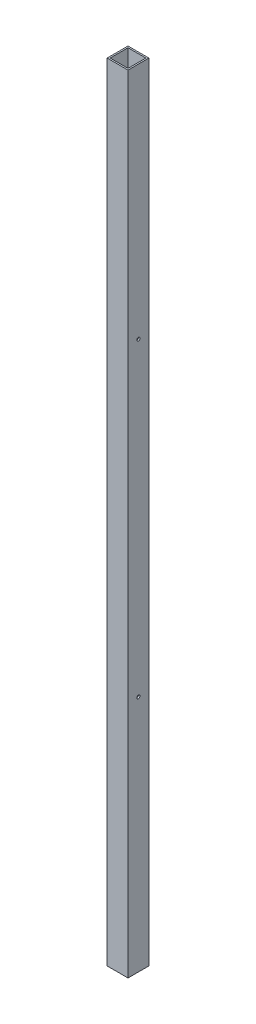
ISO-10303-21;
HEADER;
FILE_DESCRIPTION(('STEP AP214'),'2;1');
FILE_NAME('part.step','',(''),(''),'','','');
FILE_SCHEMA(('AUTOMOTIVE_DESIGN { 1 0 10303 214 1 1 1 1 }'));
ENDSEC;
DATA;
#1=APPLICATION_CONTEXT('core data for automotive mechanical design processes');
#2=APPLICATION_PROTOCOL_DEFINITION('international standard','automotive_design',2000,#1);
#3=PRODUCT_CONTEXT('',#1,'mechanical');
#4=PRODUCT('Part','Part','',(#3));
#5=PRODUCT_RELATED_PRODUCT_CATEGORY('part','',(#4));
#6=PRODUCT_DEFINITION_FORMATION('','',#4);
#7=PRODUCT_DEFINITION_CONTEXT('part definition',#1,'design');
#8=PRODUCT_DEFINITION('design','',#6,#7);
#9=PRODUCT_DEFINITION_SHAPE('','',#8);
#10=(LENGTH_UNIT() NAMED_UNIT(*) SI_UNIT(.MILLI.,.METRE.));
#11=(NAMED_UNIT(*) PLANE_ANGLE_UNIT() SI_UNIT($,.RADIAN.));
#12=(NAMED_UNIT(*) SI_UNIT($,.STERADIAN.) SOLID_ANGLE_UNIT());
#13=UNCERTAINTY_MEASURE_WITH_UNIT(LENGTH_MEASURE(1.E-05),#10,'distance_accuracy_value','');
#14=(GEOMETRIC_REPRESENTATION_CONTEXT(3) GLOBAL_UNCERTAINTY_ASSIGNED_CONTEXT((#13)) GLOBAL_UNIT_ASSIGNED_CONTEXT((#10,
#11,#12)) REPRESENTATION_CONTEXT('',''));
#15=CARTESIAN_POINT('',(0.,0.,0.));
#16=DIRECTION('',(0.,0.,1.));
#17=DIRECTION('',(1.,0.,0.));
#18=AXIS2_PLACEMENT_3D('',#15,#16,#17);
#19=CARTESIAN_POINT('',(1881.79309813872,-330.2,22.225));
#20=DIRECTION('',(1.,0.,0.));
#21=DIRECTION('',(0.,1.,0.));
#22=AXIS2_PLACEMENT_3D('',#19,#20,#21);
#23=CYLINDRICAL_SURFACE('',#22,3.3782);
#24=CARTESIAN_POINT('',(244.475,-330.2,22.225));
#25=DIRECTION('',(1.,0.,0.));
#26=DIRECTION('',(0.,1.,0.));
#27=AXIS2_PLACEMENT_3D('',#24,#25,#26);
#28=CIRCLE('',#27,3.3782);
#29=CARTESIAN_POINT('',(244.475,-326.8218,22.225));
#30=VERTEX_POINT('',#29);
#31=EDGE_CURVE('E17',#30,#30,#28,.F.);
#32=ORIENTED_EDGE('',*,*,#31,.T.);
#33=EDGE_LOOP('',(#32));
#34=FACE_BOUND('',#33,.T.);
#35=CARTESIAN_POINT('',(247.65,-330.2,22.225));
#36=DIRECTION('',(1.,0.,0.));
#37=DIRECTION('',(0.,1.,0.));
#38=AXIS2_PLACEMENT_3D('',#35,#36,#37);
#39=CIRCLE('',#38,3.3782);
#40=CARTESIAN_POINT('',(247.65,-326.8218,22.225));
#41=VERTEX_POINT('',#40);
#42=EDGE_CURVE('E117',#41,#41,#39,.F.);
#43=ORIENTED_EDGE('',*,*,#42,.F.);
#44=EDGE_LOOP('',(#43));
#45=FACE_BOUND('',#44,.T.);
#46=ADVANCED_FACE('F14',(#34,#45),#23,.F.);
#47=CARTESIAN_POINT('',(1881.79309813872,330.2,22.225));
#48=DIRECTION('',(1.,0.,0.));
#49=DIRECTION('',(0.,1.,0.));
#50=AXIS2_PLACEMENT_3D('',#47,#48,#49);
#51=CYLINDRICAL_SURFACE('',#50,3.3782);
#52=CARTESIAN_POINT('',(244.475,330.2,22.225));
#53=DIRECTION('',(1.,0.,0.));
#54=DIRECTION('',(0.,1.,0.));
#55=AXIS2_PLACEMENT_3D('',#52,#53,#54);
#56=CIRCLE('',#55,3.3782);
#57=CARTESIAN_POINT('',(244.475,333.5782,22.225));
#58=VERTEX_POINT('',#57);
#59=EDGE_CURVE('E125',#58,#58,#56,.F.);
#60=ORIENTED_EDGE('',*,*,#59,.T.);
#61=EDGE_LOOP('',(#60));
#62=FACE_BOUND('',#61,.T.);
#63=CARTESIAN_POINT('',(247.65,330.2,22.225));
#64=DIRECTION('',(1.,0.,0.));
#65=DIRECTION('',(0.,1.,0.));
#66=AXIS2_PLACEMENT_3D('',#63,#64,#65);
#67=CIRCLE('',#66,3.3782);
#68=CARTESIAN_POINT('',(247.65,333.5782,22.225));
#69=VERTEX_POINT('',#68);
#70=EDGE_CURVE('E116',#69,#69,#67,.F.);
#71=ORIENTED_EDGE('',*,*,#70,.F.);
#72=EDGE_LOOP('',(#71));
#73=FACE_BOUND('',#72,.T.);
#74=ADVANCED_FACE('F266',(#62,#73),#51,.F.);
#75=CARTESIAN_POINT('',(1881.79309813872,-330.2,22.225));
#76=DIRECTION('',(1.,0.,0.));
#77=DIRECTION('',(0.,1.,0.));
#78=AXIS2_PLACEMENT_3D('',#75,#76,#77);
#79=CYLINDRICAL_SURFACE('',#78,3.3782);
#80=CARTESIAN_POINT('',(203.2,-330.2,22.225));
#81=DIRECTION('',(1.,0.,0.));
#82=DIRECTION('',(0.,1.,0.));
#83=AXIS2_PLACEMENT_3D('',#80,#81,#82);
#84=CIRCLE('',#83,3.3782);
#85=CARTESIAN_POINT('',(203.2,-326.8218,22.225));
#86=VERTEX_POINT('',#85);
#87=EDGE_CURVE('E130',#86,#86,#84,.F.);
#88=ORIENTED_EDGE('',*,*,#87,.T.);
#89=EDGE_LOOP('',(#88));
#90=FACE_BOUND('',#89,.T.);
#91=CARTESIAN_POINT('',(206.375,-330.2,22.225));
#92=DIRECTION('',(1.,0.,0.));
#93=DIRECTION('',(0.,1.,0.));
#94=AXIS2_PLACEMENT_3D('',#91,#92,#93);
#95=CIRCLE('',#94,3.3782);
#96=CARTESIAN_POINT('',(206.375,-326.8218,22.225));
#97=VERTEX_POINT('',#96);
#98=EDGE_CURVE('E124',#97,#97,#95,.F.);
#99=ORIENTED_EDGE('',*,*,#98,.F.);
#100=EDGE_LOOP('',(#99));
#101=FACE_BOUND('',#100,.T.);
#102=ADVANCED_FACE('F257',(#90,#101),#79,.F.);
#103=CARTESIAN_POINT('',(1881.79309813872,330.2,22.225));
#104=DIRECTION('',(1.,0.,0.));
#105=DIRECTION('',(0.,1.,0.));
#106=AXIS2_PLACEMENT_3D('',#103,#104,#105);
#107=CYLINDRICAL_SURFACE('',#106,3.3782);
#108=CARTESIAN_POINT('',(203.2,330.2,22.225));
#109=DIRECTION('',(1.,0.,0.));
#110=DIRECTION('',(0.,1.,0.));
#111=AXIS2_PLACEMENT_3D('',#108,#109,#110);
#112=CIRCLE('',#111,3.3782);
#113=CARTESIAN_POINT('',(203.2,333.5782,22.225));
#114=VERTEX_POINT('',#113);
#115=EDGE_CURVE('E126',#114,#114,#112,.F.);
#116=ORIENTED_EDGE('',*,*,#115,.T.);
#117=EDGE_LOOP('',(#116));
#118=FACE_BOUND('',#117,.T.);
#119=CARTESIAN_POINT('',(206.375,330.2,22.225));
#120=DIRECTION('',(1.,0.,0.));
#121=DIRECTION('',(0.,1.,0.));
#122=AXIS2_PLACEMENT_3D('',#119,#120,#121);
#123=CIRCLE('',#122,3.3782);
#124=CARTESIAN_POINT('',(206.375,333.5782,22.225));
#125=VERTEX_POINT('',#124);
#126=EDGE_CURVE('E120',#125,#125,#123,.F.);
#127=ORIENTED_EDGE('',*,*,#126,.F.);
#128=EDGE_LOOP('',(#127));
#129=FACE_BOUND('',#128,.T.);
#130=ADVANCED_FACE('F161',(#118,#129),#107,.F.);
#131=CARTESIAN_POINT('',(-104.775,-2.55795384873636E-13,0.));
#132=DIRECTION('',(0.,0.,1.));
#133=DIRECTION('',(1.,0.,0.));
#134=AXIS2_PLACEMENT_3D('',#131,#132,#133);
#135=PLANE('',#134);
#136=DIRECTION('',(1.,0.,0.));
#137=VECTOR('',#136,1.);
#138=CARTESIAN_POINT('',(225.425,-838.2,0.));
#139=LINE('',#138,#137);
#140=CARTESIAN_POINT('',(203.2,-838.2,0.));
#141=VERTEX_POINT('',#140);
#142=CARTESIAN_POINT('',(247.65,-838.2,0.));
#143=VERTEX_POINT('',#142);
#144=EDGE_CURVE('E312',#141,#143,#139,.T.);
#145=ORIENTED_EDGE('',*,*,#144,.F.);
#146=DIRECTION('',(0.,1.,0.));
#147=VECTOR('',#146,1.);
#148=CARTESIAN_POINT('',(203.2,-2.55795384873636E-13,0.));
#149=LINE('',#148,#147);
#150=CARTESIAN_POINT('',(203.2,838.2,0.));
#151=VERTEX_POINT('',#150);
#152=EDGE_CURVE('E329',#141,#151,#149,.T.);
#153=ORIENTED_EDGE('',*,*,#152,.T.);
#154=DIRECTION('',(1.,0.,0.));
#155=VECTOR('',#154,1.);
#156=CARTESIAN_POINT('',(225.425,838.2,0.));
#157=LINE('',#156,#155);
#158=CARTESIAN_POINT('',(247.65,838.2,0.));
#159=VERTEX_POINT('',#158);
#160=EDGE_CURVE('E89',#151,#159,#157,.T.);
#161=ORIENTED_EDGE('',*,*,#160,.T.);
#162=DIRECTION('',(0.,1.,0.));
#163=VECTOR('',#162,1.);
#164=CARTESIAN_POINT('',(247.65,-2.55795384873636E-13,0.));
#165=LINE('',#164,#163);
#166=EDGE_CURVE('E113',#143,#159,#165,.T.);
#167=ORIENTED_EDGE('',*,*,#166,.F.);
#168=EDGE_LOOP('',(#145,#153,#161,#167));
#169=FACE_BOUND('',#168,.T.);
#170=ADVANCED_FACE('F151',(#169),#135,.F.);
#171=CARTESIAN_POINT('',(244.475,-2.56636462922595E-13,44.45));
#172=DIRECTION('',(1.,0.,0.));
#173=DIRECTION('',(0.,1.,0.));
#174=AXIS2_PLACEMENT_3D('',#171,#172,#173);
#175=PLANE('',#174);
#176=DIRECTION('',(0.,0.,-1.));
#177=VECTOR('',#176,1.);
#178=CARTESIAN_POINT('',(244.475,-838.2,44.45));
#179=LINE('',#178,#177);
#180=CARTESIAN_POINT('',(244.475,-838.2,41.275));
#181=VERTEX_POINT('',#180);
#182=CARTESIAN_POINT('',(244.475,-838.2,3.175));
#183=VERTEX_POINT('',#182);
#184=EDGE_CURVE('E324',#181,#183,#179,.T.);
#185=ORIENTED_EDGE('',*,*,#184,.F.);
#186=DIRECTION('',(0.,1.,0.));
#187=VECTOR('',#186,1.);
#188=CARTESIAN_POINT('',(244.475,-2.55795384873636E-13,41.275));
#189=LINE('',#188,#187);
#190=CARTESIAN_POINT('',(244.475,838.2,41.275));
#191=VERTEX_POINT('',#190);
#192=EDGE_CURVE('E99',#181,#191,#189,.T.);
#193=ORIENTED_EDGE('',*,*,#192,.T.);
#194=DIRECTION('',(0.,0.,-1.));
#195=VECTOR('',#194,1.);
#196=CARTESIAN_POINT('',(244.475,838.2,44.45));
#197=LINE('',#196,#195);
#198=CARTESIAN_POINT('',(244.475,838.2,3.175));
#199=VERTEX_POINT('',#198);
#200=EDGE_CURVE('E103',#191,#199,#197,.T.);
#201=ORIENTED_EDGE('',*,*,#200,.T.);
#202=DIRECTION('',(0.,1.,0.));
#203=VECTOR('',#202,1.);
#204=CARTESIAN_POINT('',(244.475,-2.55795384873636E-13,3.175));
#205=LINE('',#204,#203);
#206=EDGE_CURVE('E121',#183,#199,#205,.T.);
#207=ORIENTED_EDGE('',*,*,#206,.F.);
#208=EDGE_LOOP('',(#185,#193,#201,#207));
#209=FACE_BOUND('',#208,.T.);
#210=ORIENTED_EDGE('',*,*,#59,.F.);
#211=EDGE_LOOP('',(#210));
#212=FACE_BOUND('',#211,.T.);
#213=ORIENTED_EDGE('',*,*,#31,.F.);
#214=EDGE_LOOP('',(#213));
#215=FACE_BOUND('',#214,.T.);
#216=ADVANCED_FACE('F148',(#209,#212,#215),#175,.F.);
#217=CARTESIAN_POINT('',(-104.775,-2.55795384873636E-13,3.175));
#218=DIRECTION('',(0.,0.,1.));
#219=DIRECTION('',(1.,0.,0.));
#220=AXIS2_PLACEMENT_3D('',#217,#218,#219);
#221=PLANE('',#220);
#222=DIRECTION('',(0.,1.,0.));
#223=VECTOR('',#222,1.);
#224=CARTESIAN_POINT('',(206.375,-2.54954306824678E-13,3.175));
#225=LINE('',#224,#223);
#226=CARTESIAN_POINT('',(206.375,-838.2,3.175));
#227=VERTEX_POINT('',#226);
#228=CARTESIAN_POINT('',(206.375,838.2,3.175));
#229=VERTEX_POINT('',#228);
#230=EDGE_CURVE('E83',#227,#229,#225,.T.);
#231=ORIENTED_EDGE('',*,*,#230,.F.);
#232=DIRECTION('',(1.,0.,0.));
#233=VECTOR('',#232,1.);
#234=CARTESIAN_POINT('',(225.425,-838.2,3.175));
#235=LINE('',#234,#233);
#236=EDGE_CURVE('E321',#183,#227,#235,.F.);
#237=ORIENTED_EDGE('',*,*,#236,.F.);
#238=ORIENTED_EDGE('',*,*,#206,.T.);
#239=DIRECTION('',(1.,0.,0.));
#240=VECTOR('',#239,1.);
#241=CARTESIAN_POINT('',(225.425,838.2,3.175));
#242=LINE('',#241,#240);
#243=EDGE_CURVE('E105',#199,#229,#242,.F.);
#244=ORIENTED_EDGE('',*,*,#243,.T.);
#245=EDGE_LOOP('',(#231,#237,#238,#244));
#246=FACE_BOUND('',#245,.T.);
#247=ADVANCED_FACE('F150',(#246),#221,.T.);
#248=CARTESIAN_POINT('',(206.375,-2.54954306824678E-13,44.45));
#249=DIRECTION('',(1.,0.,0.));
#250=DIRECTION('',(0.,1.,0.));
#251=AXIS2_PLACEMENT_3D('',#248,#249,#250);
#252=PLANE('',#251);
#253=DIRECTION('',(0.,1.,0.));
#254=VECTOR('',#253,1.);
#255=CARTESIAN_POINT('',(206.375,-2.55795384873636E-13,41.275));
#256=LINE('',#255,#254);
#257=CARTESIAN_POINT('',(206.375,838.2,41.275));
#258=VERTEX_POINT('',#257);
#259=CARTESIAN_POINT('',(206.375,-838.2,41.275));
#260=VERTEX_POINT('',#259);
#261=EDGE_CURVE('E81',#258,#260,#256,.F.);
#262=ORIENTED_EDGE('',*,*,#261,.T.);
#263=DIRECTION('',(0.,0.,-1.));
#264=VECTOR('',#263,1.);
#265=CARTESIAN_POINT('',(206.375,-838.2,44.45));
#266=LINE('',#265,#264);
#267=EDGE_CURVE('E319',#227,#260,#266,.F.);
#268=ORIENTED_EDGE('',*,*,#267,.F.);
#269=ORIENTED_EDGE('',*,*,#230,.T.);
#270=DIRECTION('',(0.,0.,-1.));
#271=VECTOR('',#270,1.);
#272=CARTESIAN_POINT('',(206.375,838.2,44.45));
#273=LINE('',#272,#271);
#274=EDGE_CURVE('E76',#229,#258,#273,.F.);
#275=ORIENTED_EDGE('',*,*,#274,.T.);
#276=EDGE_LOOP('',(#262,#268,#269,#275));
#277=FACE_BOUND('',#276,.T.);
#278=ORIENTED_EDGE('',*,*,#126,.T.);
#279=EDGE_LOOP('',(#278));
#280=FACE_BOUND('',#279,.T.);
#281=ORIENTED_EDGE('',*,*,#98,.T.);
#282=EDGE_LOOP('',(#281));
#283=FACE_BOUND('',#282,.T.);
#284=ADVANCED_FACE('F78',(#277,#280,#283),#252,.T.);
#285=CARTESIAN_POINT('',(-104.775,-2.55795384873636E-13,41.275));
#286=DIRECTION('',(0.,0.,1.));
#287=DIRECTION('',(1.,0.,0.));
#288=AXIS2_PLACEMENT_3D('',#285,#286,#287);
#289=PLANE('',#288);
#290=DIRECTION('',(1.,0.,0.));
#291=VECTOR('',#290,1.);
#292=CARTESIAN_POINT('',(225.425,-838.2,41.275));
#293=LINE('',#292,#291);
#294=EDGE_CURVE('E97',#260,#181,#293,.T.);
#295=ORIENTED_EDGE('',*,*,#294,.F.);
#296=ORIENTED_EDGE('',*,*,#261,.F.);
#297=DIRECTION('',(1.,0.,0.));
#298=VECTOR('',#297,1.);
#299=CARTESIAN_POINT('',(225.425,838.2,41.275));
#300=LINE('',#299,#298);
#301=EDGE_CURVE('E88',#258,#191,#300,.T.);
#302=ORIENTED_EDGE('',*,*,#301,.T.);
#303=ORIENTED_EDGE('',*,*,#192,.F.);
#304=EDGE_LOOP('',(#295,#296,#302,#303));
#305=FACE_BOUND('',#304,.T.);
#306=ADVANCED_FACE('F93',(#305),#289,.F.);
#307=CARTESIAN_POINT('',(247.65,-2.55795384873636E-13,44.45));
#308=DIRECTION('',(1.,0.,0.));
#309=DIRECTION('',(0.,1.,0.));
#310=AXIS2_PLACEMENT_3D('',#307,#308,#309);
#311=PLANE('',#310);
#312=DIRECTION('',(0.,1.,0.));
#313=VECTOR('',#312,1.);
#314=CARTESIAN_POINT('',(247.65,-2.55795384873636E-13,44.45));
#315=LINE('',#314,#313);
#316=CARTESIAN_POINT('',(247.65,-838.2,44.45));
#317=VERTEX_POINT('',#316);
#318=CARTESIAN_POINT('',(247.65,838.2,44.45));
#319=VERTEX_POINT('',#318);
#320=EDGE_CURVE('E302',#317,#319,#315,.T.);
#321=ORIENTED_EDGE('',*,*,#320,.F.);
#322=DIRECTION('',(0.,0.,-1.));
#323=VECTOR('',#322,1.);
#324=CARTESIAN_POINT('',(247.65,-838.2,44.45));
#325=LINE('',#324,#323);
#326=EDGE_CURVE('E304',#143,#317,#325,.F.);
#327=ORIENTED_EDGE('',*,*,#326,.F.);
#328=ORIENTED_EDGE('',*,*,#166,.T.);
#329=DIRECTION('',(0.,0.,-1.));
#330=VECTOR('',#329,1.);
#331=CARTESIAN_POINT('',(247.65,838.2,44.45));
#332=LINE('',#331,#330);
#333=EDGE_CURVE('E111',#159,#319,#332,.F.);
#334=ORIENTED_EDGE('',*,*,#333,.T.);
#335=EDGE_LOOP('',(#321,#327,#328,#334));
#336=FACE_BOUND('',#335,.T.);
#337=ORIENTED_EDGE('',*,*,#70,.T.);
#338=EDGE_LOOP('',(#337));
#339=FACE_BOUND('',#338,.T.);
#340=ORIENTED_EDGE('',*,*,#42,.T.);
#341=EDGE_LOOP('',(#340));
#342=FACE_BOUND('',#341,.T.);
#343=ADVANCED_FACE('F182',(#336,#339,#342),#311,.T.);
#344=CARTESIAN_POINT('',(225.425,838.2,44.45));
#345=DIRECTION('',(0.,-1.,0.));
#346=DIRECTION('',(0.,0.,-1.));
#347=AXIS2_PLACEMENT_3D('',#344,#345,#346);
#348=PLANE('',#347);
#349=ORIENTED_EDGE('',*,*,#200,.F.);
#350=ORIENTED_EDGE('',*,*,#301,.F.);
#351=ORIENTED_EDGE('',*,*,#274,.F.);
#352=ORIENTED_EDGE('',*,*,#243,.F.);
#353=EDGE_LOOP('',(#349,#350,#351,#352));
#354=FACE_BOUND('',#353,.T.);
#355=DIRECTION('',(0.,0.,1.));
#356=VECTOR('',#355,1.);
#357=CARTESIAN_POINT('',(203.2,838.2,44.45));
#358=LINE('',#357,#356);
#359=CARTESIAN_POINT('',(203.2,838.2,44.45));
#360=VERTEX_POINT('',#359);
#361=EDGE_CURVE('E129',#151,#360,#358,.T.);
#362=ORIENTED_EDGE('',*,*,#361,.T.);
#363=DIRECTION('',(1.,0.,0.));
#364=VECTOR('',#363,1.);
#365=CARTESIAN_POINT('',(-104.775,838.2,44.45));
#366=LINE('',#365,#364);
#367=EDGE_CURVE('E309',#319,#360,#366,.F.);
#368=ORIENTED_EDGE('',*,*,#367,.F.);
#369=ORIENTED_EDGE('',*,*,#333,.F.);
#370=ORIENTED_EDGE('',*,*,#160,.F.);
#371=EDGE_LOOP('',(#362,#368,#369,#370));
#372=FACE_BOUND('',#371,.T.);
#373=ADVANCED_FACE('F101',(#354,#372),#348,.F.);
#374=CARTESIAN_POINT('',(203.2,-2.55795384873636E-13,44.45));
#375=DIRECTION('',(1.,0.,0.));
#376=DIRECTION('',(0.,1.,0.));
#377=AXIS2_PLACEMENT_3D('',#374,#375,#376);
#378=PLANE('',#377);
#379=DIRECTION('',(0.,0.,-1.));
#380=VECTOR('',#379,1.);
#381=CARTESIAN_POINT('',(203.2,-838.2,44.45));
#382=LINE('',#381,#380);
#383=CARTESIAN_POINT('',(203.2,-838.2,44.45));
#384=VERTEX_POINT('',#383);
#385=EDGE_CURVE('E32',#384,#141,#382,.T.);
#386=ORIENTED_EDGE('',*,*,#385,.F.);
#387=DIRECTION('',(0.,1.,0.));
#388=VECTOR('',#387,1.);
#389=CARTESIAN_POINT('',(203.2,-2.55795384873636E-13,44.45));
#390=LINE('',#389,#388);
#391=EDGE_CURVE('E23',#360,#384,#390,.F.);
#392=ORIENTED_EDGE('',*,*,#391,.F.);
#393=ORIENTED_EDGE('',*,*,#361,.F.);
#394=ORIENTED_EDGE('',*,*,#152,.F.);
#395=EDGE_LOOP('',(#386,#392,#393,#394));
#396=FACE_BOUND('',#395,.T.);
#397=ORIENTED_EDGE('',*,*,#115,.F.);
#398=EDGE_LOOP('',(#397));
#399=FACE_BOUND('',#398,.T.);
#400=ORIENTED_EDGE('',*,*,#87,.F.);
#401=EDGE_LOOP('',(#400));
#402=FACE_BOUND('',#401,.T.);
#403=ADVANCED_FACE('F173',(#396,#399,#402),#378,.F.);
#404=CARTESIAN_POINT('',(225.425,-838.2,44.45));
#405=DIRECTION('',(0.,-1.,0.));
#406=DIRECTION('',(0.,0.,-1.));
#407=AXIS2_PLACEMENT_3D('',#404,#405,#406);
#408=PLANE('',#407);
#409=ORIENTED_EDGE('',*,*,#267,.T.);
#410=ORIENTED_EDGE('',*,*,#294,.T.);
#411=ORIENTED_EDGE('',*,*,#184,.T.);
#412=ORIENTED_EDGE('',*,*,#236,.T.);
#413=EDGE_LOOP('',(#409,#410,#411,#412));
#414=FACE_BOUND('',#413,.T.);
#415=DIRECTION('',(1.,0.,0.));
#416=VECTOR('',#415,1.);
#417=CARTESIAN_POINT('',(-104.775,-838.2,44.45));
#418=LINE('',#417,#416);
#419=EDGE_CURVE('E9',#384,#317,#418,.T.);
#420=ORIENTED_EDGE('',*,*,#419,.F.);
#421=ORIENTED_EDGE('',*,*,#385,.T.);
#422=ORIENTED_EDGE('',*,*,#144,.T.);
#423=ORIENTED_EDGE('',*,*,#326,.T.);
#424=EDGE_LOOP('',(#420,#421,#422,#423));
#425=FACE_BOUND('',#424,.T.);
#426=ADVANCED_FACE('F167',(#414,#425),#408,.T.);
#427=CARTESIAN_POINT('',(-104.775,-2.55795384873636E-13,44.45));
#428=DIRECTION('',(0.,0.,1.));
#429=DIRECTION('',(1.,0.,0.));
#430=AXIS2_PLACEMENT_3D('',#427,#428,#429);
#431=PLANE('',#430);
#432=ORIENTED_EDGE('',*,*,#391,.T.);
#433=ORIENTED_EDGE('',*,*,#419,.T.);
#434=ORIENTED_EDGE('',*,*,#320,.T.);
#435=ORIENTED_EDGE('',*,*,#367,.T.);
#436=EDGE_LOOP('',(#432,#433,#434,#435));
#437=FACE_BOUND('',#436,.T.);
#438=ADVANCED_FACE('F165',(#437),#431,.T.);
#439=CLOSED_SHELL('',(#46,#74,#102,#130,#170,#216,#247,#284,#306,#343,#373,#403,#426,#438));
#440=MANIFOLD_SOLID_BREP('B1',#439);
#441=ADVANCED_BREP_SHAPE_REPRESENTATION('',(#18,#440),#14);
#442=SHAPE_DEFINITION_REPRESENTATION(#9,#441);
ENDSEC;
END-ISO-10303-21;
